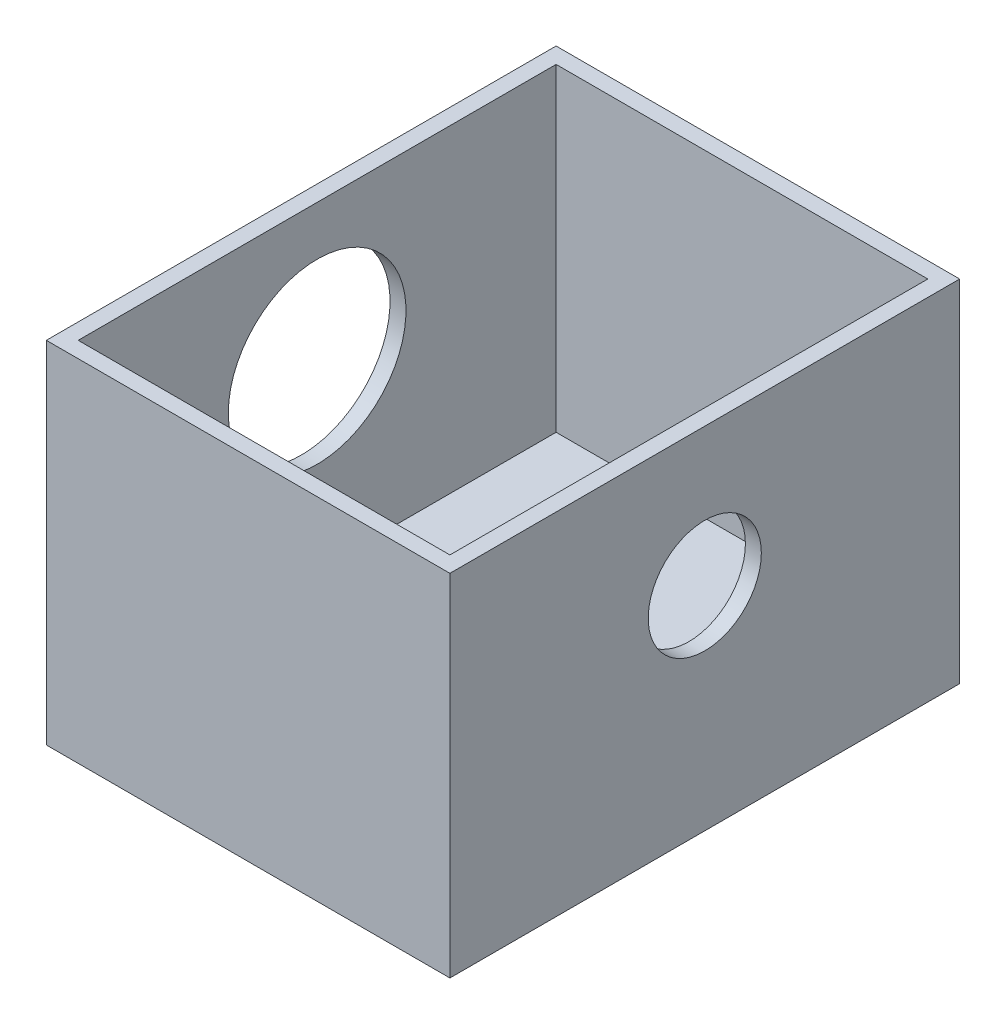
ISO-10303-21;
HEADER;
FILE_DESCRIPTION(('STEP AP214'),'2;1');
FILE_NAME('part.step','',(''),(''),'','','');
FILE_SCHEMA(('AUTOMOTIVE_DESIGN { 1 0 10303 214 1 1 1 1 }'));
ENDSEC;
DATA;
#1=APPLICATION_CONTEXT('core data for automotive mechanical design processes');
#2=APPLICATION_PROTOCOL_DEFINITION('international standard','automotive_design',2000,#1);
#3=PRODUCT_CONTEXT('',#1,'mechanical');
#4=PRODUCT('Part','Part','',(#3));
#5=PRODUCT_RELATED_PRODUCT_CATEGORY('part','',(#4));
#6=PRODUCT_DEFINITION_FORMATION('','',#4);
#7=PRODUCT_DEFINITION_CONTEXT('part definition',#1,'design');
#8=PRODUCT_DEFINITION('design','',#6,#7);
#9=PRODUCT_DEFINITION_SHAPE('','',#8);
#10=(LENGTH_UNIT() NAMED_UNIT(*) SI_UNIT(.MILLI.,.METRE.));
#11=(NAMED_UNIT(*) PLANE_ANGLE_UNIT() SI_UNIT($,.RADIAN.));
#12=(NAMED_UNIT(*) SI_UNIT($,.STERADIAN.) SOLID_ANGLE_UNIT());
#13=UNCERTAINTY_MEASURE_WITH_UNIT(LENGTH_MEASURE(1.E-05),#10,'distance_accuracy_value','');
#14=(GEOMETRIC_REPRESENTATION_CONTEXT(3) GLOBAL_UNCERTAINTY_ASSIGNED_CONTEXT((#13)) GLOBAL_UNIT_ASSIGNED_CONTEXT((#10,
#11,#12)) REPRESENTATION_CONTEXT('',''));
#15=CARTESIAN_POINT('',(0.,0.,0.));
#16=DIRECTION('',(0.,0.,1.));
#17=DIRECTION('',(1.,0.,0.));
#18=AXIS2_PLACEMENT_3D('',#15,#16,#17);
#19=CARTESIAN_POINT('',(1.68419917012448,8.382,-7.57573443983403));
#20=DIRECTION('',(0.,0.,1.));
#21=DIRECTION('',(1.,0.,0.));
#22=AXIS2_PLACEMENT_3D('',#19,#20,#21);
#23=PLANE('',#22);
#24=DIRECTION('',(-1.,0.,0.));
#25=VECTOR('',#24,1.);
#26=CARTESIAN_POINT('',(1.68419917012448,0.,-7.57573443983403));
#27=LINE('',#26,#25);
#28=CARTESIAN_POINT('',(1.68419917012448,0.,-7.57573443983403));
#29=VERTEX_POINT('',#28);
#30=CARTESIAN_POINT('',(-7.96780082987552,0.,-7.57573443983402));
#31=VERTEX_POINT('',#30);
#32=EDGE_CURVE('E148',#29,#31,#27,.T.);
#33=ORIENTED_EDGE('',*,*,#32,.T.);
#34=DIRECTION('',(0.,-1.,0.));
#35=VECTOR('',#34,1.);
#36=CARTESIAN_POINT('',(-7.96780082987552,8.382,-7.57573443983402));
#37=LINE('',#36,#35);
#38=CARTESIAN_POINT('',(-7.96780082987552,8.382,-7.57573443983402));
#39=VERTEX_POINT('',#38);
#40=EDGE_CURVE('E11',#39,#31,#37,.T.);
#41=ORIENTED_EDGE('',*,*,#40,.F.);
#42=DIRECTION('',(-1.,0.,0.));
#43=VECTOR('',#42,1.);
#44=CARTESIAN_POINT('',(1.68419917012448,8.382,-7.57573443983403));
#45=LINE('',#44,#43);
#46=CARTESIAN_POINT('',(1.68419917012448,8.382,-7.57573443983403));
#47=VERTEX_POINT('',#46);
#48=EDGE_CURVE('E152',#47,#39,#45,.T.);
#49=ORIENTED_EDGE('',*,*,#48,.F.);
#50=DIRECTION('',(0.,-1.,0.));
#51=VECTOR('',#50,1.);
#52=CARTESIAN_POINT('',(1.68419917012448,8.382,-7.57573443983403));
#53=LINE('',#52,#51);
#54=EDGE_CURVE('E158',#47,#29,#53,.T.);
#55=ORIENTED_EDGE('',*,*,#54,.T.);
#56=EDGE_LOOP('',(#33,#41,#49,#55));
#57=FACE_BOUND('',#56,.T.);
#58=ADVANCED_FACE('F37',(#57),#23,.F.);
#59=CARTESIAN_POINT('',(-7.96780082987552,8.382,-7.57573443983402));
#60=DIRECTION('',(1.,0.,0.));
#61=DIRECTION('',(0.,0.,-1.));
#62=AXIS2_PLACEMENT_3D('',#59,#60,#61);
#63=PLANE('',#62);
#64=CARTESIAN_POINT('',(-7.96780082987552,5.08,-1.47973443983403));
#65=DIRECTION('',(-1.,0.,0.));
#66=DIRECTION('',(0.,0.,1.));
#67=AXIS2_PLACEMENT_3D('',#64,#65,#66);
#68=CIRCLE('',#67,2.12471);
#69=CARTESIAN_POINT('',(-7.96780082987552,5.08,0.644975560165975));
#70=VERTEX_POINT('',#69);
#71=EDGE_CURVE('E204',#70,#70,#68,.T.);
#72=ORIENTED_EDGE('',*,*,#71,.F.);
#73=EDGE_LOOP('',(#72));
#74=FACE_BOUND('',#73,.T.);
#75=DIRECTION('',(0.,0.,1.));
#76=VECTOR('',#75,1.);
#77=CARTESIAN_POINT('',(-7.96780082987552,0.,-7.57573443983402));
#78=LINE('',#77,#76);
#79=CARTESIAN_POINT('',(-7.96780082987552,0.,4.61626556016598));
#80=VERTEX_POINT('',#79);
#81=EDGE_CURVE('E161',#31,#80,#78,.T.);
#82=ORIENTED_EDGE('',*,*,#81,.T.);
#83=DIRECTION('',(0.,-1.,0.));
#84=VECTOR('',#83,1.);
#85=CARTESIAN_POINT('',(-7.96780082987552,8.382,4.61626556016598));
#86=LINE('',#85,#84);
#87=CARTESIAN_POINT('',(-7.96780082987552,8.382,4.61626556016598));
#88=VERTEX_POINT('',#87);
#89=EDGE_CURVE('E44',#88,#80,#86,.T.);
#90=ORIENTED_EDGE('',*,*,#89,.F.);
#91=DIRECTION('',(0.,0.,1.));
#92=VECTOR('',#91,1.);
#93=CARTESIAN_POINT('',(-7.96780082987552,8.382,-7.57573443983402));
#94=LINE('',#93,#92);
#95=EDGE_CURVE('E88',#39,#88,#94,.T.);
#96=ORIENTED_EDGE('',*,*,#95,.F.);
#97=ORIENTED_EDGE('',*,*,#40,.T.);
#98=EDGE_LOOP('',(#82,#90,#96,#97));
#99=FACE_BOUND('',#98,.T.);
#100=ADVANCED_FACE('F191',(#74,#99),#63,.F.);
#101=CARTESIAN_POINT('',(-7.96780082987552,8.382,4.61626556016598));
#102=DIRECTION('',(0.,0.,-1.));
#103=DIRECTION('',(-1.,0.,0.));
#104=AXIS2_PLACEMENT_3D('',#101,#102,#103);
#105=PLANE('',#104);
#106=DIRECTION('',(1.,0.,0.));
#107=VECTOR('',#106,1.);
#108=CARTESIAN_POINT('',(-7.96780082987552,0.,4.61626556016598));
#109=LINE('',#108,#107);
#110=CARTESIAN_POINT('',(1.68419917012448,0.,4.61626556016598));
#111=VERTEX_POINT('',#110);
#112=EDGE_CURVE('E163',#80,#111,#109,.T.);
#113=ORIENTED_EDGE('',*,*,#112,.T.);
#114=DIRECTION('',(0.,-1.,0.));
#115=VECTOR('',#114,1.);
#116=CARTESIAN_POINT('',(1.68419917012448,8.382,4.61626556016598));
#117=LINE('',#116,#115);
#118=CARTESIAN_POINT('',(1.68419917012448,8.382,4.61626556016598));
#119=VERTEX_POINT('',#118);
#120=EDGE_CURVE('E167',#119,#111,#117,.T.);
#121=ORIENTED_EDGE('',*,*,#120,.F.);
#122=DIRECTION('',(1.,0.,0.));
#123=VECTOR('',#122,1.);
#124=CARTESIAN_POINT('',(-7.96780082987552,8.382,4.61626556016598));
#125=LINE('',#124,#123);
#126=EDGE_CURVE('E155',#88,#119,#125,.T.);
#127=ORIENTED_EDGE('',*,*,#126,.F.);
#128=ORIENTED_EDGE('',*,*,#89,.T.);
#129=EDGE_LOOP('',(#113,#121,#127,#128));
#130=FACE_BOUND('',#129,.T.);
#131=ADVANCED_FACE('F172',(#130),#105,.F.);
#132=CARTESIAN_POINT('',(1.68419917012448,8.382,4.61626556016598));
#133=DIRECTION('',(-1.,0.,0.));
#134=DIRECTION('',(0.,0.,1.));
#135=AXIS2_PLACEMENT_3D('',#132,#133,#134);
#136=PLANE('',#135);
#137=CARTESIAN_POINT('',(1.68419917012448,5.08,-1.47973443983403));
#138=DIRECTION('',(1.,0.,0.));
#139=DIRECTION('',(0.,0.,-1.));
#140=AXIS2_PLACEMENT_3D('',#137,#138,#139);
#141=CIRCLE('',#140,1.35254999999999);
#142=CARTESIAN_POINT('',(1.68419917012448,5.08,-2.83228443983401));
#143=VERTEX_POINT('',#142);
#144=EDGE_CURVE('E209',#143,#143,#141,.T.);
#145=ORIENTED_EDGE('',*,*,#144,.F.);
#146=EDGE_LOOP('',(#145));
#147=FACE_BOUND('',#146,.T.);
#148=DIRECTION('',(0.,0.,-1.));
#149=VECTOR('',#148,1.);
#150=CARTESIAN_POINT('',(1.68419917012448,0.,4.61626556016598));
#151=LINE('',#150,#149);
#152=EDGE_CURVE('E81',#111,#29,#151,.T.);
#153=ORIENTED_EDGE('',*,*,#152,.T.);
#154=ORIENTED_EDGE('',*,*,#54,.F.);
#155=DIRECTION('',(0.,0.,-1.));
#156=VECTOR('',#155,1.);
#157=CARTESIAN_POINT('',(1.68419917012448,8.382,4.61626556016598));
#158=LINE('',#157,#156);
#159=EDGE_CURVE('E60',#119,#47,#158,.T.);
#160=ORIENTED_EDGE('',*,*,#159,.F.);
#161=ORIENTED_EDGE('',*,*,#120,.T.);
#162=EDGE_LOOP('',(#153,#154,#160,#161));
#163=FACE_BOUND('',#162,.T.);
#164=ADVANCED_FACE('F180',(#147,#163),#136,.F.);
#165=CARTESIAN_POINT('',(0.,8.382,0.));
#166=DIRECTION('',(0.,1.,0.));
#167=DIRECTION('',(0.,0.,1.));
#168=AXIS2_PLACEMENT_3D('',#165,#166,#167);
#169=PLANE('',#168);
#170=DIRECTION('',(1.,0.,0.));
#171=VECTOR('',#170,1.);
#172=CARTESIAN_POINT('',(-7.58680082987552,8.382,4.23526556016597));
#173=LINE('',#172,#171);
#174=CARTESIAN_POINT('',(-7.58680082987552,8.382,4.23526556016597));
#175=VERTEX_POINT('',#174);
#176=CARTESIAN_POINT('',(1.30319917012448,8.382,4.23526556016597));
#177=VERTEX_POINT('',#176);
#178=EDGE_CURVE('E51',#175,#177,#173,.T.);
#179=ORIENTED_EDGE('',*,*,#178,.F.);
#180=DIRECTION('',(0.,0.,1.));
#181=VECTOR('',#180,1.);
#182=CARTESIAN_POINT('',(-7.58680082987552,8.382,-7.19473443983402));
#183=LINE('',#182,#181);
#184=CARTESIAN_POINT('',(-7.58680082987552,8.382,-7.19473443983402));
#185=VERTEX_POINT('',#184);
#186=EDGE_CURVE('E130',#185,#175,#183,.T.);
#187=ORIENTED_EDGE('',*,*,#186,.F.);
#188=DIRECTION('',(-1.,0.,0.));
#189=VECTOR('',#188,1.);
#190=CARTESIAN_POINT('',(1.30319917012448,8.382,-7.19473443983403));
#191=LINE('',#190,#189);
#192=CARTESIAN_POINT('',(1.30319917012448,8.382,-7.19473443983403));
#193=VERTEX_POINT('',#192);
#194=EDGE_CURVE('E133',#193,#185,#191,.T.);
#195=ORIENTED_EDGE('',*,*,#194,.F.);
#196=DIRECTION('',(0.,0.,-1.));
#197=VECTOR('',#196,1.);
#198=CARTESIAN_POINT('',(1.30319917012448,8.382,4.23526556016597));
#199=LINE('',#198,#197);
#200=EDGE_CURVE('E142',#177,#193,#199,.T.);
#201=ORIENTED_EDGE('',*,*,#200,.F.);
#202=EDGE_LOOP('',(#179,#187,#195,#201));
#203=FACE_BOUND('',#202,.T.);
#204=ORIENTED_EDGE('',*,*,#48,.T.);
#205=ORIENTED_EDGE('',*,*,#95,.T.);
#206=ORIENTED_EDGE('',*,*,#126,.T.);
#207=ORIENTED_EDGE('',*,*,#159,.T.);
#208=EDGE_LOOP('',(#204,#205,#206,#207));
#209=FACE_BOUND('',#208,.T.);
#210=ADVANCED_FACE('F182',(#203,#209),#169,.T.);
#211=CARTESIAN_POINT('',(0.,0.,0.));
#212=DIRECTION('',(0.,1.,0.));
#213=DIRECTION('',(0.,0.,1.));
#214=AXIS2_PLACEMENT_3D('',#211,#212,#213);
#215=PLANE('',#214);
#216=ORIENTED_EDGE('',*,*,#32,.F.);
#217=ORIENTED_EDGE('',*,*,#152,.F.);
#218=ORIENTED_EDGE('',*,*,#112,.F.);
#219=ORIENTED_EDGE('',*,*,#81,.F.);
#220=EDGE_LOOP('',(#216,#217,#218,#219));
#221=FACE_BOUND('',#220,.T.);
#222=ADVANCED_FACE('F176',(#221),#215,.F.);
#223=CARTESIAN_POINT('',(-7.58680082987552,0.762000000000001,4.23526556016597));
#224=DIRECTION('',(0.,0.,1.));
#225=DIRECTION('',(1.,0.,0.));
#226=AXIS2_PLACEMENT_3D('',#223,#224,#225);
#227=PLANE('',#226);
#228=ORIENTED_EDGE('',*,*,#178,.T.);
#229=DIRECTION('',(0.,1.,0.));
#230=VECTOR('',#229,1.);
#231=CARTESIAN_POINT('',(1.30319917012448,0.762000000000001,4.23526556016597));
#232=LINE('',#231,#230);
#233=CARTESIAN_POINT('',(1.30319917012448,0.762000000000001,4.23526556016597));
#234=VERTEX_POINT('',#233);
#235=EDGE_CURVE('E108',#234,#177,#232,.T.);
#236=ORIENTED_EDGE('',*,*,#235,.F.);
#237=DIRECTION('',(1.,0.,0.));
#238=VECTOR('',#237,1.);
#239=CARTESIAN_POINT('',(-7.58680082987552,0.762000000000001,4.23526556016597));
#240=LINE('',#239,#238);
#241=CARTESIAN_POINT('',(-7.58680082987552,0.762000000000001,4.23526556016597));
#242=VERTEX_POINT('',#241);
#243=EDGE_CURVE('E112',#242,#234,#240,.T.);
#244=ORIENTED_EDGE('',*,*,#243,.F.);
#245=DIRECTION('',(0.,1.,0.));
#246=VECTOR('',#245,1.);
#247=CARTESIAN_POINT('',(-7.58680082987552,0.762000000000001,4.23526556016597));
#248=LINE('',#247,#246);
#249=EDGE_CURVE('E146',#242,#175,#248,.T.);
#250=ORIENTED_EDGE('',*,*,#249,.T.);
#251=EDGE_LOOP('',(#228,#236,#244,#250));
#252=FACE_BOUND('',#251,.T.);
#253=ADVANCED_FACE('F110',(#252),#227,.F.);
#254=CARTESIAN_POINT('',(-7.58680082987552,0.762000000000001,-7.19473443983402));
#255=DIRECTION('',(-1.,0.,0.));
#256=DIRECTION('',(0.,0.,1.));
#257=AXIS2_PLACEMENT_3D('',#254,#255,#256);
#258=PLANE('',#257);
#259=CARTESIAN_POINT('',(-7.58680082987552,5.08,-1.47973443983403));
#260=DIRECTION('',(-1.,0.,0.));
#261=DIRECTION('',(0.,0.,1.));
#262=AXIS2_PLACEMENT_3D('',#259,#260,#261);
#263=CIRCLE('',#262,2.12471);
#264=CARTESIAN_POINT('',(-7.58680082987552,5.08,0.644975560165975));
#265=VERTEX_POINT('',#264);
#266=EDGE_CURVE('E136',#265,#265,#263,.F.);
#267=ORIENTED_EDGE('',*,*,#266,.F.);
#268=EDGE_LOOP('',(#267));
#269=FACE_BOUND('',#268,.T.);
#270=ORIENTED_EDGE('',*,*,#186,.T.);
#271=ORIENTED_EDGE('',*,*,#249,.F.);
#272=DIRECTION('',(0.,0.,1.));
#273=VECTOR('',#272,1.);
#274=CARTESIAN_POINT('',(-7.58680082987552,0.762000000000001,-7.19473443983402));
#275=LINE('',#274,#273);
#276=CARTESIAN_POINT('',(-7.58680082987552,0.762000000000001,-7.19473443983402));
#277=VERTEX_POINT('',#276);
#278=EDGE_CURVE('E118',#277,#242,#275,.T.);
#279=ORIENTED_EDGE('',*,*,#278,.F.);
#280=DIRECTION('',(0.,1.,0.));
#281=VECTOR('',#280,1.);
#282=CARTESIAN_POINT('',(-7.58680082987552,0.762000000000001,-7.19473443983402));
#283=LINE('',#282,#281);
#284=EDGE_CURVE('E149',#277,#185,#283,.T.);
#285=ORIENTED_EDGE('',*,*,#284,.T.);
#286=EDGE_LOOP('',(#270,#271,#279,#285));
#287=FACE_BOUND('',#286,.T.);
#288=ADVANCED_FACE('F227',(#269,#287),#258,.F.);
#289=CARTESIAN_POINT('',(1.30319917012448,0.762000000000001,-7.19473443983403));
#290=DIRECTION('',(0.,0.,-1.));
#291=DIRECTION('',(-1.,0.,0.));
#292=AXIS2_PLACEMENT_3D('',#289,#290,#291);
#293=PLANE('',#292);
#294=ORIENTED_EDGE('',*,*,#194,.T.);
#295=ORIENTED_EDGE('',*,*,#284,.F.);
#296=DIRECTION('',(-1.,0.,0.));
#297=VECTOR('',#296,1.);
#298=CARTESIAN_POINT('',(1.30319917012448,0.762000000000001,-7.19473443983403));
#299=LINE('',#298,#297);
#300=CARTESIAN_POINT('',(1.30319917012448,0.762000000000001,-7.19473443983403));
#301=VERTEX_POINT('',#300);
#302=EDGE_CURVE('E126',#301,#277,#299,.T.);
#303=ORIENTED_EDGE('',*,*,#302,.F.);
#304=DIRECTION('',(0.,1.,0.));
#305=VECTOR('',#304,1.);
#306=CARTESIAN_POINT('',(1.30319917012448,0.762000000000001,-7.19473443983403));
#307=LINE('',#306,#305);
#308=EDGE_CURVE('E117',#301,#193,#307,.T.);
#309=ORIENTED_EDGE('',*,*,#308,.T.);
#310=EDGE_LOOP('',(#294,#295,#303,#309));
#311=FACE_BOUND('',#310,.T.);
#312=ADVANCED_FACE('F230',(#311),#293,.F.);
#313=CARTESIAN_POINT('',(1.30319917012448,0.762000000000001,4.23526556016597));
#314=DIRECTION('',(1.,0.,0.));
#315=DIRECTION('',(0.,0.,-1.));
#316=AXIS2_PLACEMENT_3D('',#313,#314,#315);
#317=PLANE('',#316);
#318=CARTESIAN_POINT('',(1.30319917012448,5.08,-1.47973443983403));
#319=DIRECTION('',(1.,0.,0.));
#320=DIRECTION('',(0.,0.,-1.));
#321=AXIS2_PLACEMENT_3D('',#318,#319,#320);
#322=CIRCLE('',#321,1.35254999999999);
#323=CARTESIAN_POINT('',(1.30319917012448,5.08,-2.83228443983402));
#324=VERTEX_POINT('',#323);
#325=EDGE_CURVE('E206',#324,#324,#322,.T.);
#326=ORIENTED_EDGE('',*,*,#325,.T.);
#327=EDGE_LOOP('',(#326));
#328=FACE_BOUND('',#327,.T.);
#329=ORIENTED_EDGE('',*,*,#200,.T.);
#330=ORIENTED_EDGE('',*,*,#308,.F.);
#331=DIRECTION('',(0.,0.,-1.));
#332=VECTOR('',#331,1.);
#333=CARTESIAN_POINT('',(1.30319917012448,0.762000000000001,4.23526556016597));
#334=LINE('',#333,#332);
#335=EDGE_CURVE('E121',#234,#301,#334,.T.);
#336=ORIENTED_EDGE('',*,*,#335,.F.);
#337=ORIENTED_EDGE('',*,*,#235,.T.);
#338=EDGE_LOOP('',(#329,#330,#336,#337));
#339=FACE_BOUND('',#338,.T.);
#340=ADVANCED_FACE('F122',(#328,#339),#317,.F.);
#341=CARTESIAN_POINT('',(0.,0.762000000000001,0.));
#342=DIRECTION('',(0.,1.,0.));
#343=DIRECTION('',(0.,0.,1.));
#344=AXIS2_PLACEMENT_3D('',#341,#342,#343);
#345=PLANE('',#344);
#346=ORIENTED_EDGE('',*,*,#243,.T.);
#347=ORIENTED_EDGE('',*,*,#335,.T.);
#348=ORIENTED_EDGE('',*,*,#302,.T.);
#349=ORIENTED_EDGE('',*,*,#278,.T.);
#350=EDGE_LOOP('',(#346,#347,#348,#349));
#351=FACE_BOUND('',#350,.T.);
#352=ADVANCED_FACE('F128',(#351),#345,.T.);
#353=CARTESIAN_POINT('',(1.68519917012448,5.08,-1.47973443983403));
#354=DIRECTION('',(-1.,0.,0.));
#355=DIRECTION('',(0.,0.,1.));
#356=AXIS2_PLACEMENT_3D('',#353,#354,#355);
#357=CYLINDRICAL_SURFACE('',#356,2.12471);
#358=ORIENTED_EDGE('',*,*,#71,.T.);
#359=EDGE_LOOP('',(#358));
#360=FACE_BOUND('',#359,.T.);
#361=ORIENTED_EDGE('',*,*,#266,.T.);
#362=EDGE_LOOP('',(#361));
#363=FACE_BOUND('',#362,.T.);
#364=ADVANCED_FACE('F216',(#360,#363),#357,.F.);
#365=CARTESIAN_POINT('',(1.68419917012448,5.08,-1.47973443983403));
#366=DIRECTION('',(1.,0.,0.));
#367=DIRECTION('',(0.,0.,-1.));
#368=AXIS2_PLACEMENT_3D('',#365,#366,#367);
#369=CYLINDRICAL_SURFACE('',#368,1.35254999999999);
#370=ORIENTED_EDGE('',*,*,#325,.F.);
#371=EDGE_LOOP('',(#370));
#372=FACE_BOUND('',#371,.T.);
#373=ORIENTED_EDGE('',*,*,#144,.T.);
#374=EDGE_LOOP('',(#373));
#375=FACE_BOUND('',#374,.T.);
#376=ADVANCED_FACE('F214',(#372,#375),#369,.F.);
#377=CLOSED_SHELL('',(#58,#100,#131,#164,#210,#222,#253,#288,#312,#340,#352,#364,#376));
#378=MANIFOLD_SOLID_BREP('B2',#377);
#379=ADVANCED_BREP_SHAPE_REPRESENTATION('',(#18,#378),#14);
#380=SHAPE_DEFINITION_REPRESENTATION(#9,#379);
ENDSEC;
END-ISO-10303-21;
